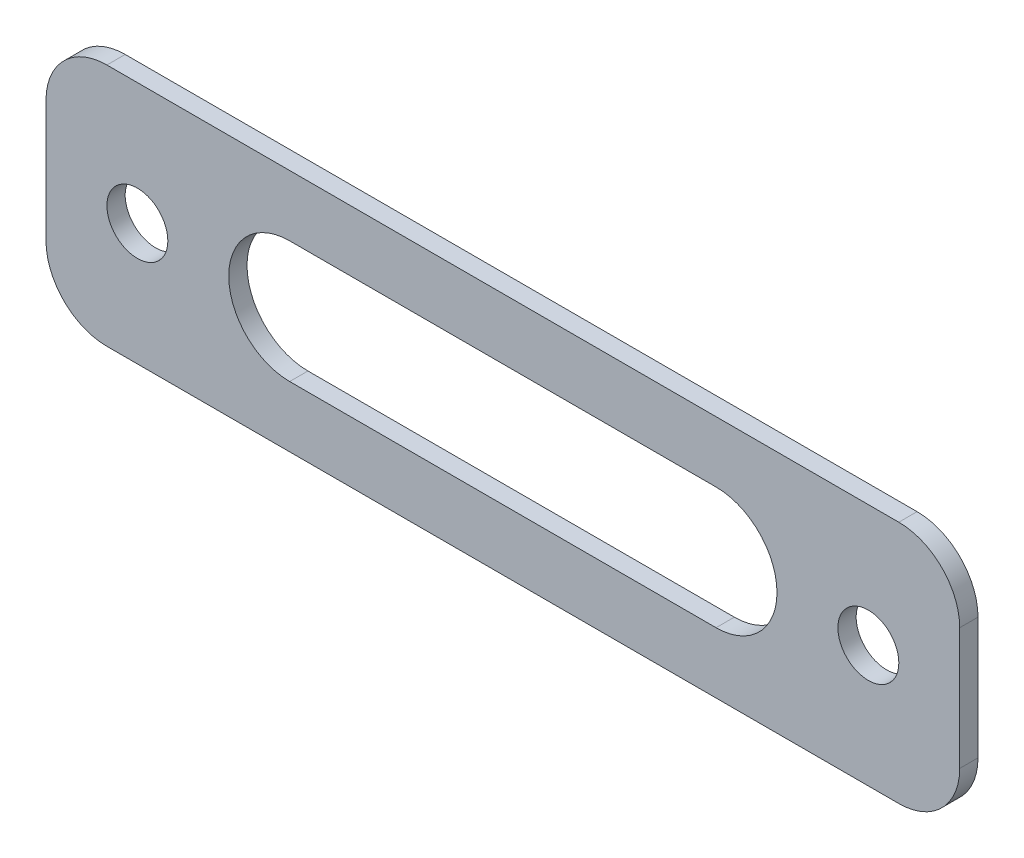
ISO-10303-21;
HEADER;
FILE_DESCRIPTION(('STEP AP214'),'2;1');
FILE_NAME('part.step','',(''),(''),'','','');
FILE_SCHEMA(('AUTOMOTIVE_DESIGN { 1 0 10303 214 1 1 1 1 }'));
ENDSEC;
DATA;
#1=APPLICATION_CONTEXT('core data for automotive mechanical design processes');
#2=APPLICATION_PROTOCOL_DEFINITION('international standard','automotive_design',2000,#1);
#3=PRODUCT_CONTEXT('',#1,'mechanical');
#4=PRODUCT('Part','Part','',(#3));
#5=PRODUCT_RELATED_PRODUCT_CATEGORY('part','',(#4));
#6=PRODUCT_DEFINITION_FORMATION('','',#4);
#7=PRODUCT_DEFINITION_CONTEXT('part definition',#1,'design');
#8=PRODUCT_DEFINITION('design','',#6,#7);
#9=PRODUCT_DEFINITION_SHAPE('','',#8);
#10=(LENGTH_UNIT() NAMED_UNIT(*) SI_UNIT(.MILLI.,.METRE.));
#11=(NAMED_UNIT(*) PLANE_ANGLE_UNIT() SI_UNIT($,.RADIAN.));
#12=(NAMED_UNIT(*) SI_UNIT($,.STERADIAN.) SOLID_ANGLE_UNIT());
#13=UNCERTAINTY_MEASURE_WITH_UNIT(LENGTH_MEASURE(1.E-05),#10,'distance_accuracy_value','');
#14=(GEOMETRIC_REPRESENTATION_CONTEXT(3) GLOBAL_UNCERTAINTY_ASSIGNED_CONTEXT((#13)) GLOBAL_UNIT_ASSIGNED_CONTEXT((#10,
#11,#12)) REPRESENTATION_CONTEXT('',''));
#15=CARTESIAN_POINT('',(0.,0.,0.));
#16=DIRECTION('',(0.,0.,1.));
#17=DIRECTION('',(1.,0.,0.));
#18=AXIS2_PLACEMENT_3D('',#15,#16,#17);
#19=CARTESIAN_POINT('',(47.625,-12.7,1.905));
#20=DIRECTION('',(0.,0.,1.));
#21=DIRECTION('',(1.,0.,0.));
#22=AXIS2_PLACEMENT_3D('',#19,#20,#21);
#23=PLANE('',#22);
#24=CARTESIAN_POINT('',(-22.225,0.,1.905));
#25=DIRECTION('',(0.,0.,1.));
#26=DIRECTION('',(1.,0.,0.));
#27=AXIS2_PLACEMENT_3D('',#24,#25,#26);
#28=CIRCLE('',#27,6.35);
#29=CARTESIAN_POINT('',(-22.225,6.35,1.905));
#30=VERTEX_POINT('',#29);
#31=CARTESIAN_POINT('',(-22.225,-6.35,1.905));
#32=VERTEX_POINT('',#31);
#33=EDGE_CURVE('E129',#30,#32,#28,.T.);
#34=ORIENTED_EDGE('',*,*,#33,.F.);
#35=DIRECTION('',(-1.,0.,0.));
#36=VECTOR('',#35,1.);
#37=CARTESIAN_POINT('',(-22.225,6.35,1.905));
#38=LINE('',#37,#36);
#39=CARTESIAN_POINT('',(22.225,6.35,1.905));
#40=VERTEX_POINT('',#39);
#41=EDGE_CURVE('E147',#40,#30,#38,.T.);
#42=ORIENTED_EDGE('',*,*,#41,.F.);
#43=CARTESIAN_POINT('',(22.225,0.,1.905));
#44=DIRECTION('',(0.,0.,1.));
#45=DIRECTION('',(1.,0.,0.));
#46=AXIS2_PLACEMENT_3D('',#43,#44,#45);
#47=CIRCLE('',#46,6.35);
#48=CARTESIAN_POINT('',(22.225,-6.35,1.905));
#49=VERTEX_POINT('',#48);
#50=EDGE_CURVE('E150',#49,#40,#47,.T.);
#51=ORIENTED_EDGE('',*,*,#50,.F.);
#52=DIRECTION('',(1.,0.,0.));
#53=VECTOR('',#52,1.);
#54=CARTESIAN_POINT('',(-22.225,-6.35,1.905));
#55=LINE('',#54,#53);
#56=EDGE_CURVE('E156',#32,#49,#55,.T.);
#57=ORIENTED_EDGE('',*,*,#56,.F.);
#58=EDGE_LOOP('',(#34,#42,#51,#57));
#59=FACE_BOUND('',#58,.T.);
#60=CARTESIAN_POINT('',(-38.1,0.,1.905));
#61=DIRECTION('',(0.,0.,1.));
#62=DIRECTION('',(1.,0.,0.));
#63=AXIS2_PLACEMENT_3D('',#60,#61,#62);
#64=CIRCLE('',#63,3.175);
#65=CARTESIAN_POINT('',(-34.925,0.,1.905));
#66=VERTEX_POINT('',#65);
#67=EDGE_CURVE('E172',#66,#66,#64,.T.);
#68=ORIENTED_EDGE('',*,*,#67,.F.);
#69=EDGE_LOOP('',(#68));
#70=FACE_BOUND('',#69,.T.);
#71=DIRECTION('',(1.,0.,0.));
#72=VECTOR('',#71,1.);
#73=CARTESIAN_POINT('',(-47.625,-12.7,1.905));
#74=LINE('',#73,#72);
#75=CARTESIAN_POINT('',(-41.275,-12.7,1.905));
#76=VERTEX_POINT('',#75);
#77=CARTESIAN_POINT('',(41.275,-12.7,1.905));
#78=VERTEX_POINT('',#77);
#79=EDGE_CURVE('E186',#76,#78,#74,.T.);
#80=ORIENTED_EDGE('',*,*,#79,.T.);
#81=CARTESIAN_POINT('',(41.275,-6.35,1.905));
#82=DIRECTION('',(0.,0.,1.));
#83=DIRECTION('',(1.,0.,0.));
#84=AXIS2_PLACEMENT_3D('',#81,#82,#83);
#85=CIRCLE('',#84,6.35);
#86=CARTESIAN_POINT('',(47.625,-6.35,1.905));
#87=VERTEX_POINT('',#86);
#88=EDGE_CURVE('E221',#78,#87,#85,.T.);
#89=ORIENTED_EDGE('',*,*,#88,.T.);
#90=DIRECTION('',(0.,1.,0.));
#91=VECTOR('',#90,1.);
#92=CARTESIAN_POINT('',(47.625,12.7,1.905));
#93=LINE('',#92,#91);
#94=CARTESIAN_POINT('',(47.625,6.35,1.905));
#95=VERTEX_POINT('',#94);
#96=EDGE_CURVE('E178',#87,#95,#93,.T.);
#97=ORIENTED_EDGE('',*,*,#96,.T.);
#98=CARTESIAN_POINT('',(41.275,6.35,1.905));
#99=DIRECTION('',(0.,0.,1.));
#100=DIRECTION('',(1.,0.,0.));
#101=AXIS2_PLACEMENT_3D('',#98,#99,#100);
#102=CIRCLE('',#101,6.35);
#103=CARTESIAN_POINT('',(41.275,12.7,1.905));
#104=VERTEX_POINT('',#103);
#105=EDGE_CURVE('E219',#95,#104,#102,.T.);
#106=ORIENTED_EDGE('',*,*,#105,.T.);
#107=DIRECTION('',(-1.,0.,0.));
#108=VECTOR('',#107,1.);
#109=CARTESIAN_POINT('',(-47.625,12.7,1.905));
#110=LINE('',#109,#108);
#111=CARTESIAN_POINT('',(-41.275,12.7,1.905));
#112=VERTEX_POINT('',#111);
#113=EDGE_CURVE('E181',#104,#112,#110,.T.);
#114=ORIENTED_EDGE('',*,*,#113,.T.);
#115=CARTESIAN_POINT('',(-41.275,6.35,1.905));
#116=DIRECTION('',(0.,0.,1.));
#117=DIRECTION('',(1.,0.,0.));
#118=AXIS2_PLACEMENT_3D('',#115,#116,#117);
#119=CIRCLE('',#118,6.35);
#120=CARTESIAN_POINT('',(-47.625,6.35,1.905));
#121=VERTEX_POINT('',#120);
#122=EDGE_CURVE('E53',#112,#121,#119,.T.);
#123=ORIENTED_EDGE('',*,*,#122,.T.);
#124=DIRECTION('',(0.,-1.,0.));
#125=VECTOR('',#124,1.);
#126=CARTESIAN_POINT('',(-47.625,12.7,1.905));
#127=LINE('',#126,#125);
#128=CARTESIAN_POINT('',(-47.625,-6.35,1.905));
#129=VERTEX_POINT('',#128);
#130=EDGE_CURVE('E184',#121,#129,#127,.T.);
#131=ORIENTED_EDGE('',*,*,#130,.T.);
#132=CARTESIAN_POINT('',(-41.275,-6.35,1.905));
#133=DIRECTION('',(0.,0.,1.));
#134=DIRECTION('',(1.,0.,0.));
#135=AXIS2_PLACEMENT_3D('',#132,#133,#134);
#136=CIRCLE('',#135,6.35);
#137=EDGE_CURVE('E217',#129,#76,#136,.T.);
#138=ORIENTED_EDGE('',*,*,#137,.T.);
#139=EDGE_LOOP('',(#80,#89,#97,#106,#114,#123,#131,#138));
#140=FACE_BOUND('',#139,.T.);
#141=CARTESIAN_POINT('',(38.1,0.,1.905));
#142=DIRECTION('',(0.,0.,1.));
#143=DIRECTION('',(1.,0.,0.));
#144=AXIS2_PLACEMENT_3D('',#141,#142,#143);
#145=CIRCLE('',#144,3.175);
#146=CARTESIAN_POINT('',(41.275,0.,1.905));
#147=VERTEX_POINT('',#146);
#148=EDGE_CURVE('E166',#147,#147,#145,.T.);
#149=ORIENTED_EDGE('',*,*,#148,.F.);
#150=EDGE_LOOP('',(#149));
#151=FACE_BOUND('',#150,.T.);
#152=ADVANCED_FACE('F33',(#59,#70,#140,#151),#23,.T.);
#153=CARTESIAN_POINT('',(47.625,-12.7,0.));
#154=DIRECTION('',(0.,0.,1.));
#155=DIRECTION('',(1.,0.,0.));
#156=AXIS2_PLACEMENT_3D('',#153,#154,#155);
#157=PLANE('',#156);
#158=DIRECTION('',(-1.,0.,0.));
#159=VECTOR('',#158,1.);
#160=CARTESIAN_POINT('',(-22.225,6.35,0.));
#161=LINE('',#160,#159);
#162=CARTESIAN_POINT('',(22.225,6.35,0.));
#163=VERTEX_POINT('',#162);
#164=CARTESIAN_POINT('',(-22.225,6.35,0.));
#165=VERTEX_POINT('',#164);
#166=EDGE_CURVE('E134',#163,#165,#161,.T.);
#167=ORIENTED_EDGE('',*,*,#166,.T.);
#168=CARTESIAN_POINT('',(-22.225,0.,0.));
#169=DIRECTION('',(0.,0.,1.));
#170=DIRECTION('',(1.,0.,0.));
#171=AXIS2_PLACEMENT_3D('',#168,#169,#170);
#172=CIRCLE('',#171,6.35);
#173=CARTESIAN_POINT('',(-22.225,-6.35,0.));
#174=VERTEX_POINT('',#173);
#175=EDGE_CURVE('E126',#165,#174,#172,.T.);
#176=ORIENTED_EDGE('',*,*,#175,.T.);
#177=DIRECTION('',(1.,0.,0.));
#178=VECTOR('',#177,1.);
#179=CARTESIAN_POINT('',(-22.225,-6.35,0.));
#180=LINE('',#179,#178);
#181=CARTESIAN_POINT('',(22.225,-6.35,0.));
#182=VERTEX_POINT('',#181);
#183=EDGE_CURVE('E138',#174,#182,#180,.T.);
#184=ORIENTED_EDGE('',*,*,#183,.T.);
#185=CARTESIAN_POINT('',(22.225,0.,0.));
#186=DIRECTION('',(0.,0.,1.));
#187=DIRECTION('',(1.,0.,0.));
#188=AXIS2_PLACEMENT_3D('',#185,#186,#187);
#189=CIRCLE('',#188,6.35);
#190=EDGE_CURVE('E142',#182,#163,#189,.T.);
#191=ORIENTED_EDGE('',*,*,#190,.T.);
#192=EDGE_LOOP('',(#167,#176,#184,#191));
#193=FACE_BOUND('',#192,.T.);
#194=CARTESIAN_POINT('',(-38.1,0.,0.));
#195=DIRECTION('',(0.,0.,1.));
#196=DIRECTION('',(1.,0.,0.));
#197=AXIS2_PLACEMENT_3D('',#194,#195,#196);
#198=CIRCLE('',#197,3.175);
#199=CARTESIAN_POINT('',(-34.925,0.,0.));
#200=VERTEX_POINT('',#199);
#201=EDGE_CURVE('E169',#200,#200,#198,.T.);
#202=ORIENTED_EDGE('',*,*,#201,.T.);
#203=EDGE_LOOP('',(#202));
#204=FACE_BOUND('',#203,.T.);
#205=DIRECTION('',(0.,1.,0.));
#206=VECTOR('',#205,1.);
#207=CARTESIAN_POINT('',(47.625,12.7,0.));
#208=LINE('',#207,#206);
#209=CARTESIAN_POINT('',(47.625,-6.35,0.));
#210=VERTEX_POINT('',#209);
#211=CARTESIAN_POINT('',(47.625,6.35,0.));
#212=VERTEX_POINT('',#211);
#213=EDGE_CURVE('E175',#210,#212,#208,.T.);
#214=ORIENTED_EDGE('',*,*,#213,.F.);
#215=CARTESIAN_POINT('',(41.275,-6.35,0.));
#216=DIRECTION('',(0.,0.,1.));
#217=DIRECTION('',(1.,0.,0.));
#218=AXIS2_PLACEMENT_3D('',#215,#216,#217);
#219=CIRCLE('',#218,6.35);
#220=CARTESIAN_POINT('',(41.275,-12.7,0.));
#221=VERTEX_POINT('',#220);
#222=EDGE_CURVE('E209',#210,#221,#219,.F.);
#223=ORIENTED_EDGE('',*,*,#222,.T.);
#224=DIRECTION('',(1.,0.,0.));
#225=VECTOR('',#224,1.);
#226=CARTESIAN_POINT('',(-47.625,-12.7,0.));
#227=LINE('',#226,#225);
#228=CARTESIAN_POINT('',(-41.275,-12.7,0.));
#229=VERTEX_POINT('',#228);
#230=EDGE_CURVE('E182',#229,#221,#227,.T.);
#231=ORIENTED_EDGE('',*,*,#230,.F.);
#232=CARTESIAN_POINT('',(-41.275,-6.35,0.));
#233=DIRECTION('',(0.,0.,1.));
#234=DIRECTION('',(1.,0.,0.));
#235=AXIS2_PLACEMENT_3D('',#232,#233,#234);
#236=CIRCLE('',#235,6.35);
#237=CARTESIAN_POINT('',(-47.625,-6.35,0.));
#238=VERTEX_POINT('',#237);
#239=EDGE_CURVE('E205',#229,#238,#236,.F.);
#240=ORIENTED_EDGE('',*,*,#239,.T.);
#241=DIRECTION('',(0.,-1.,0.));
#242=VECTOR('',#241,1.);
#243=CARTESIAN_POINT('',(-47.625,12.7,0.));
#244=LINE('',#243,#242);
#245=CARTESIAN_POINT('',(-47.625,6.35,0.));
#246=VERTEX_POINT('',#245);
#247=EDGE_CURVE('E195',#246,#238,#244,.T.);
#248=ORIENTED_EDGE('',*,*,#247,.F.);
#249=CARTESIAN_POINT('',(-41.275,6.35,0.));
#250=DIRECTION('',(0.,0.,1.));
#251=DIRECTION('',(1.,0.,0.));
#252=AXIS2_PLACEMENT_3D('',#249,#250,#251);
#253=CIRCLE('',#252,6.35);
#254=CARTESIAN_POINT('',(-41.275,12.7,0.));
#255=VERTEX_POINT('',#254);
#256=EDGE_CURVE('E203',#246,#255,#253,.F.);
#257=ORIENTED_EDGE('',*,*,#256,.T.);
#258=DIRECTION('',(-1.,0.,0.));
#259=VECTOR('',#258,1.);
#260=CARTESIAN_POINT('',(-47.625,12.7,0.));
#261=LINE('',#260,#259);
#262=CARTESIAN_POINT('',(41.275,12.7,0.));
#263=VERTEX_POINT('',#262);
#264=EDGE_CURVE('E192',#263,#255,#261,.T.);
#265=ORIENTED_EDGE('',*,*,#264,.F.);
#266=CARTESIAN_POINT('',(41.275,6.35,0.));
#267=DIRECTION('',(0.,0.,1.));
#268=DIRECTION('',(1.,0.,0.));
#269=AXIS2_PLACEMENT_3D('',#266,#267,#268);
#270=CIRCLE('',#269,6.35);
#271=EDGE_CURVE('E207',#263,#212,#270,.F.);
#272=ORIENTED_EDGE('',*,*,#271,.T.);
#273=EDGE_LOOP('',(#214,#223,#231,#240,#248,#257,#265,#272));
#274=FACE_BOUND('',#273,.T.);
#275=CARTESIAN_POINT('',(38.1,0.,0.));
#276=DIRECTION('',(0.,0.,1.));
#277=DIRECTION('',(1.,0.,0.));
#278=AXIS2_PLACEMENT_3D('',#275,#276,#277);
#279=CIRCLE('',#278,3.175);
#280=CARTESIAN_POINT('',(41.275,0.,0.));
#281=VERTEX_POINT('',#280);
#282=EDGE_CURVE('E162',#281,#281,#279,.T.);
#283=ORIENTED_EDGE('',*,*,#282,.T.);
#284=EDGE_LOOP('',(#283));
#285=FACE_BOUND('',#284,.T.);
#286=ADVANCED_FACE('F144',(#193,#204,#274,#285),#157,.F.);
#287=CARTESIAN_POINT('',(47.625,12.7,1.905));
#288=DIRECTION('',(-1.,0.,0.));
#289=DIRECTION('',(0.,-1.,0.));
#290=AXIS2_PLACEMENT_3D('',#287,#288,#289);
#291=PLANE('',#290);
#292=ORIENTED_EDGE('',*,*,#96,.F.);
#293=DIRECTION('',(0.,0.,-1.));
#294=VECTOR('',#293,1.);
#295=CARTESIAN_POINT('',(47.625,-6.35,1.905));
#296=LINE('',#295,#294);
#297=EDGE_CURVE('E200',#87,#210,#296,.T.);
#298=ORIENTED_EDGE('',*,*,#297,.T.);
#299=ORIENTED_EDGE('',*,*,#213,.T.);
#300=DIRECTION('',(0.,0.,-1.));
#301=VECTOR('',#300,1.);
#302=CARTESIAN_POINT('',(47.625,6.35,1.905));
#303=LINE('',#302,#301);
#304=EDGE_CURVE('E189',#212,#95,#303,.F.);
#305=ORIENTED_EDGE('',*,*,#304,.T.);
#306=EDGE_LOOP('',(#292,#298,#299,#305));
#307=FACE_BOUND('',#306,.T.);
#308=ADVANCED_FACE('F252',(#307),#291,.F.);
#309=CARTESIAN_POINT('',(-47.625,12.7,1.905));
#310=DIRECTION('',(0.,-1.,0.));
#311=DIRECTION('',(0.,0.,-1.));
#312=AXIS2_PLACEMENT_3D('',#309,#310,#311);
#313=PLANE('',#312);
#314=ORIENTED_EDGE('',*,*,#113,.F.);
#315=DIRECTION('',(0.,0.,-1.));
#316=VECTOR('',#315,1.);
#317=CARTESIAN_POINT('',(41.275,12.7,1.905));
#318=LINE('',#317,#316);
#319=EDGE_CURVE('E225',#104,#263,#318,.T.);
#320=ORIENTED_EDGE('',*,*,#319,.T.);
#321=ORIENTED_EDGE('',*,*,#264,.T.);
#322=DIRECTION('',(0.,0.,-1.));
#323=VECTOR('',#322,1.);
#324=CARTESIAN_POINT('',(-41.275,12.7,1.905));
#325=LINE('',#324,#323);
#326=EDGE_CURVE('E223',#255,#112,#325,.F.);
#327=ORIENTED_EDGE('',*,*,#326,.T.);
#328=EDGE_LOOP('',(#314,#320,#321,#327));
#329=FACE_BOUND('',#328,.T.);
#330=ADVANCED_FACE('F260',(#329),#313,.F.);
#331=CARTESIAN_POINT('',(-47.625,12.7,1.905));
#332=DIRECTION('',(1.,0.,0.));
#333=DIRECTION('',(0.,1.,0.));
#334=AXIS2_PLACEMENT_3D('',#331,#332,#333);
#335=PLANE('',#334);
#336=ORIENTED_EDGE('',*,*,#247,.T.);
#337=DIRECTION('',(0.,0.,-1.));
#338=VECTOR('',#337,1.);
#339=CARTESIAN_POINT('',(-47.625,-6.35,1.905));
#340=LINE('',#339,#338);
#341=EDGE_CURVE('E11',#238,#129,#340,.F.);
#342=ORIENTED_EDGE('',*,*,#341,.T.);
#343=ORIENTED_EDGE('',*,*,#130,.F.);
#344=DIRECTION('',(0.,0.,-1.));
#345=VECTOR('',#344,1.);
#346=CARTESIAN_POINT('',(-47.625,6.35,1.905));
#347=LINE('',#346,#345);
#348=EDGE_CURVE('E41',#121,#246,#347,.T.);
#349=ORIENTED_EDGE('',*,*,#348,.T.);
#350=EDGE_LOOP('',(#336,#342,#343,#349));
#351=FACE_BOUND('',#350,.T.);
#352=ADVANCED_FACE('F230',(#351),#335,.F.);
#353=CARTESIAN_POINT('',(-47.625,-12.7,1.905));
#354=DIRECTION('',(0.,1.,0.));
#355=DIRECTION('',(0.,0.,1.));
#356=AXIS2_PLACEMENT_3D('',#353,#354,#355);
#357=PLANE('',#356);
#358=ORIENTED_EDGE('',*,*,#230,.T.);
#359=DIRECTION('',(0.,0.,-1.));
#360=VECTOR('',#359,1.);
#361=CARTESIAN_POINT('',(41.275,-12.7,1.905));
#362=LINE('',#361,#360);
#363=EDGE_CURVE('E214',#221,#78,#362,.F.);
#364=ORIENTED_EDGE('',*,*,#363,.T.);
#365=ORIENTED_EDGE('',*,*,#79,.F.);
#366=DIRECTION('',(0.,0.,-1.));
#367=VECTOR('',#366,1.);
#368=CARTESIAN_POINT('',(-41.275,-12.7,1.905));
#369=LINE('',#368,#367);
#370=EDGE_CURVE('E211',#76,#229,#369,.T.);
#371=ORIENTED_EDGE('',*,*,#370,.T.);
#372=EDGE_LOOP('',(#358,#364,#365,#371));
#373=FACE_BOUND('',#372,.T.);
#374=ADVANCED_FACE('F243',(#373),#357,.F.);
#375=CARTESIAN_POINT('',(-38.1,0.,1.905));
#376=DIRECTION('',(0.,0.,-1.));
#377=DIRECTION('',(-1.,0.,0.));
#378=AXIS2_PLACEMENT_3D('',#375,#376,#377);
#379=CYLINDRICAL_SURFACE('',#378,3.175);
#380=ORIENTED_EDGE('',*,*,#67,.T.);
#381=EDGE_LOOP('',(#380));
#382=FACE_BOUND('',#381,.T.);
#383=ORIENTED_EDGE('',*,*,#201,.F.);
#384=EDGE_LOOP('',(#383));
#385=FACE_BOUND('',#384,.T.);
#386=ADVANCED_FACE('F275',(#382,#385),#379,.F.);
#387=CARTESIAN_POINT('',(38.1,0.,1.905));
#388=DIRECTION('',(0.,0.,-1.));
#389=DIRECTION('',(-1.,0.,0.));
#390=AXIS2_PLACEMENT_3D('',#387,#388,#389);
#391=CYLINDRICAL_SURFACE('',#390,3.175);
#392=ORIENTED_EDGE('',*,*,#148,.T.);
#393=EDGE_LOOP('',(#392));
#394=FACE_BOUND('',#393,.T.);
#395=ORIENTED_EDGE('',*,*,#282,.F.);
#396=EDGE_LOOP('',(#395));
#397=FACE_BOUND('',#396,.T.);
#398=ADVANCED_FACE('F343',(#394,#397),#391,.F.);
#399=CARTESIAN_POINT('',(-22.225,0.,0.));
#400=DIRECTION('',(0.,0.,1.));
#401=DIRECTION('',(1.,0.,0.));
#402=AXIS2_PLACEMENT_3D('',#399,#400,#401);
#403=CYLINDRICAL_SURFACE('',#402,6.35);
#404=ORIENTED_EDGE('',*,*,#33,.T.);
#405=DIRECTION('',(0.,0.,1.));
#406=VECTOR('',#405,1.);
#407=CARTESIAN_POINT('',(-22.225,-6.35,0.));
#408=LINE('',#407,#406);
#409=EDGE_CURVE('E122',#174,#32,#408,.T.);
#410=ORIENTED_EDGE('',*,*,#409,.F.);
#411=ORIENTED_EDGE('',*,*,#175,.F.);
#412=DIRECTION('',(0.,0.,1.));
#413=VECTOR('',#412,1.);
#414=CARTESIAN_POINT('',(-22.225,6.35,0.));
#415=LINE('',#414,#413);
#416=EDGE_CURVE('E160',#165,#30,#415,.T.);
#417=ORIENTED_EDGE('',*,*,#416,.T.);
#418=EDGE_LOOP('',(#404,#410,#411,#417));
#419=FACE_BOUND('',#418,.T.);
#420=ADVANCED_FACE('F124',(#419),#403,.F.);
#421=CARTESIAN_POINT('',(-22.225,6.35,0.));
#422=DIRECTION('',(0.,1.,0.));
#423=DIRECTION('',(0.,0.,1.));
#424=AXIS2_PLACEMENT_3D('',#421,#422,#423);
#425=PLANE('',#424);
#426=ORIENTED_EDGE('',*,*,#41,.T.);
#427=ORIENTED_EDGE('',*,*,#416,.F.);
#428=ORIENTED_EDGE('',*,*,#166,.F.);
#429=DIRECTION('',(0.,0.,1.));
#430=VECTOR('',#429,1.);
#431=CARTESIAN_POINT('',(22.225,6.35,0.));
#432=LINE('',#431,#430);
#433=EDGE_CURVE('E163',#163,#40,#432,.T.);
#434=ORIENTED_EDGE('',*,*,#433,.T.);
#435=EDGE_LOOP('',(#426,#427,#428,#434));
#436=FACE_BOUND('',#435,.T.);
#437=ADVANCED_FACE('F326',(#436),#425,.F.);
#438=CARTESIAN_POINT('',(22.225,0.,0.));
#439=DIRECTION('',(0.,0.,1.));
#440=DIRECTION('',(1.,0.,0.));
#441=AXIS2_PLACEMENT_3D('',#438,#439,#440);
#442=CYLINDRICAL_SURFACE('',#441,6.35);
#443=ORIENTED_EDGE('',*,*,#50,.T.);
#444=ORIENTED_EDGE('',*,*,#433,.F.);
#445=ORIENTED_EDGE('',*,*,#190,.F.);
#446=DIRECTION('',(0.,0.,1.));
#447=VECTOR('',#446,1.);
#448=CARTESIAN_POINT('',(22.225,-6.35,0.));
#449=LINE('',#448,#447);
#450=EDGE_CURVE('E133',#182,#49,#449,.T.);
#451=ORIENTED_EDGE('',*,*,#450,.T.);
#452=EDGE_LOOP('',(#443,#444,#445,#451));
#453=FACE_BOUND('',#452,.T.);
#454=ADVANCED_FACE('F318',(#453),#442,.F.);
#455=CARTESIAN_POINT('',(-22.225,-6.35,0.));
#456=DIRECTION('',(0.,-1.,0.));
#457=DIRECTION('',(0.,0.,-1.));
#458=AXIS2_PLACEMENT_3D('',#455,#456,#457);
#459=PLANE('',#458);
#460=ORIENTED_EDGE('',*,*,#56,.T.);
#461=ORIENTED_EDGE('',*,*,#450,.F.);
#462=ORIENTED_EDGE('',*,*,#183,.F.);
#463=ORIENTED_EDGE('',*,*,#409,.T.);
#464=EDGE_LOOP('',(#460,#461,#462,#463));
#465=FACE_BOUND('',#464,.T.);
#466=ADVANCED_FACE('F139',(#465),#459,.F.);
#467=CARTESIAN_POINT('',(41.275,-6.35,1.905));
#468=DIRECTION('',(0.,0.,-1.));
#469=DIRECTION('',(-1.,0.,0.));
#470=AXIS2_PLACEMENT_3D('',#467,#468,#469);
#471=CYLINDRICAL_SURFACE('',#470,6.35);
#472=ORIENTED_EDGE('',*,*,#88,.F.);
#473=ORIENTED_EDGE('',*,*,#363,.F.);
#474=ORIENTED_EDGE('',*,*,#222,.F.);
#475=ORIENTED_EDGE('',*,*,#297,.F.);
#476=EDGE_LOOP('',(#472,#473,#474,#475));
#477=FACE_BOUND('',#476,.T.);
#478=ADVANCED_FACE('F250',(#477),#471,.T.);
#479=CARTESIAN_POINT('',(41.275,6.35,1.905));
#480=DIRECTION('',(0.,0.,-1.));
#481=DIRECTION('',(-1.,0.,0.));
#482=AXIS2_PLACEMENT_3D('',#479,#480,#481);
#483=CYLINDRICAL_SURFACE('',#482,6.35);
#484=ORIENTED_EDGE('',*,*,#105,.F.);
#485=ORIENTED_EDGE('',*,*,#304,.F.);
#486=ORIENTED_EDGE('',*,*,#271,.F.);
#487=ORIENTED_EDGE('',*,*,#319,.F.);
#488=EDGE_LOOP('',(#484,#485,#486,#487));
#489=FACE_BOUND('',#488,.T.);
#490=ADVANCED_FACE('F257',(#489),#483,.T.);
#491=CARTESIAN_POINT('',(-41.275,-6.35,1.905));
#492=DIRECTION('',(0.,0.,-1.));
#493=DIRECTION('',(-1.,0.,0.));
#494=AXIS2_PLACEMENT_3D('',#491,#492,#493);
#495=CYLINDRICAL_SURFACE('',#494,6.35);
#496=ORIENTED_EDGE('',*,*,#137,.F.);
#497=ORIENTED_EDGE('',*,*,#341,.F.);
#498=ORIENTED_EDGE('',*,*,#239,.F.);
#499=ORIENTED_EDGE('',*,*,#370,.F.);
#500=EDGE_LOOP('',(#496,#497,#498,#499));
#501=FACE_BOUND('',#500,.T.);
#502=ADVANCED_FACE('F240',(#501),#495,.T.);
#503=CARTESIAN_POINT('',(-41.275,6.35,1.905));
#504=DIRECTION('',(0.,0.,-1.));
#505=DIRECTION('',(-1.,0.,0.));
#506=AXIS2_PLACEMENT_3D('',#503,#504,#505);
#507=CYLINDRICAL_SURFACE('',#506,6.35);
#508=ORIENTED_EDGE('',*,*,#122,.F.);
#509=ORIENTED_EDGE('',*,*,#326,.F.);
#510=ORIENTED_EDGE('',*,*,#256,.F.);
#511=ORIENTED_EDGE('',*,*,#348,.F.);
#512=EDGE_LOOP('',(#508,#509,#510,#511));
#513=FACE_BOUND('',#512,.T.);
#514=ADVANCED_FACE('F35',(#513),#507,.T.);
#515=CLOSED_SHELL('',(#152,#286,#308,#330,#352,#374,#386,#398,#420,#437,#454,#466,#478,#490,
#502,#514));
#516=MANIFOLD_SOLID_BREP('B2',#515);
#517=ADVANCED_BREP_SHAPE_REPRESENTATION('',(#18,#516),#14);
#518=SHAPE_DEFINITION_REPRESENTATION(#9,#517);
ENDSEC;
END-ISO-10303-21;
